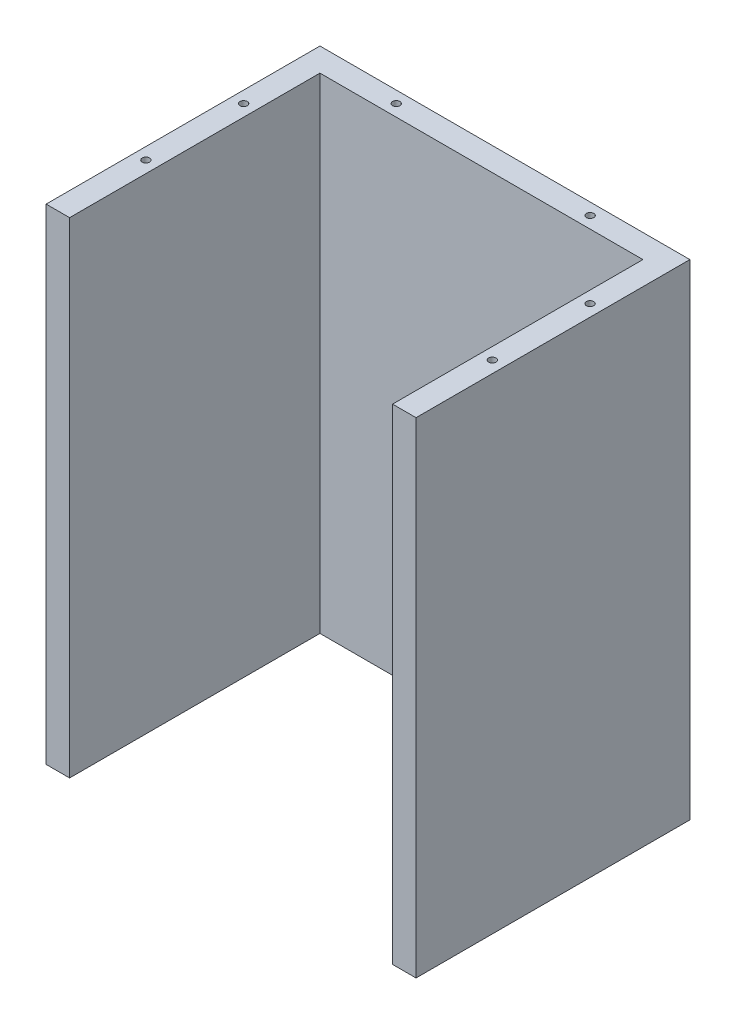
ISO-10303-21;
HEADER;
FILE_DESCRIPTION(('STEP AP214'),'2;1');
FILE_NAME('part.step','',(''),(''),'','','');
FILE_SCHEMA(('AUTOMOTIVE_DESIGN { 1 0 10303 214 1 1 1 1 }'));
ENDSEC;
DATA;
#1=APPLICATION_CONTEXT('core data for automotive mechanical design processes');
#2=APPLICATION_PROTOCOL_DEFINITION('international standard','automotive_design',2000,#1);
#3=PRODUCT_CONTEXT('',#1,'mechanical');
#4=PRODUCT('Part','Part','',(#3));
#5=PRODUCT_RELATED_PRODUCT_CATEGORY('part','',(#4));
#6=PRODUCT_DEFINITION_FORMATION('','',#4);
#7=PRODUCT_DEFINITION_CONTEXT('part definition',#1,'design');
#8=PRODUCT_DEFINITION('design','',#6,#7);
#9=PRODUCT_DEFINITION_SHAPE('','',#8);
#10=(LENGTH_UNIT() NAMED_UNIT(*) SI_UNIT(.MILLI.,.METRE.));
#11=(NAMED_UNIT(*) PLANE_ANGLE_UNIT() SI_UNIT($,.RADIAN.));
#12=(NAMED_UNIT(*) SI_UNIT($,.STERADIAN.) SOLID_ANGLE_UNIT());
#13=UNCERTAINTY_MEASURE_WITH_UNIT(LENGTH_MEASURE(1.E-05),#10,'distance_accuracy_value','');
#14=(GEOMETRIC_REPRESENTATION_CONTEXT(3) GLOBAL_UNCERTAINTY_ASSIGNED_CONTEXT((#13)) GLOBAL_UNIT_ASSIGNED_CONTEXT((#10,
#11,#12)) REPRESENTATION_CONTEXT('',''));
#15=CARTESIAN_POINT('',(0.,0.,0.));
#16=DIRECTION('',(0.,0.,1.));
#17=DIRECTION('',(1.,0.,0.));
#18=AXIS2_PLACEMENT_3D('',#15,#16,#17);
#19=CARTESIAN_POINT('',(90.043,-423.302,82.55));
#20=DIRECTION('',(-1.,0.,0.));
#21=DIRECTION('',(0.,0.,1.));
#22=AXIS2_PLACEMENT_3D('',#19,#20,#21);
#23=PLANE('',#22);
#24=DIRECTION('',(0.,0.,1.));
#25=VECTOR('',#24,1.);
#26=CARTESIAN_POINT('',(90.043,-420.,82.55));
#27=LINE('',#26,#25);
#28=CARTESIAN_POINT('',(90.043,-420.,-59.25));
#29=VERTEX_POINT('',#28);
#30=CARTESIAN_POINT('',(90.043,-420.,59.25));
#31=VERTEX_POINT('',#30);
#32=EDGE_CURVE('E134',#29,#31,#27,.T.);
#33=ORIENTED_EDGE('',*,*,#32,.F.);
#34=DIRECTION('',(0.,-1.,0.));
#35=VECTOR('',#34,1.);
#36=CARTESIAN_POINT('',(90.043,-210.,-59.25));
#37=LINE('',#36,#35);
#38=CARTESIAN_POINT('',(90.043,-210.,-59.25));
#39=VERTEX_POINT('',#38);
#40=EDGE_CURVE('E179',#39,#29,#37,.T.);
#41=ORIENTED_EDGE('',*,*,#40,.F.);
#42=DIRECTION('',(0.,0.,1.));
#43=VECTOR('',#42,1.);
#44=CARTESIAN_POINT('',(90.043,-210.,0.));
#45=LINE('',#44,#43);
#46=CARTESIAN_POINT('',(90.043,-210.,59.25));
#47=VERTEX_POINT('',#46);
#48=EDGE_CURVE('E164',#39,#47,#45,.T.);
#49=ORIENTED_EDGE('',*,*,#48,.T.);
#50=DIRECTION('',(0.,-1.,0.));
#51=VECTOR('',#50,1.);
#52=CARTESIAN_POINT('',(90.043,-210.,59.25));
#53=LINE('',#52,#51);
#54=EDGE_CURVE('E147',#47,#31,#53,.T.);
#55=ORIENTED_EDGE('',*,*,#54,.T.);
#56=EDGE_LOOP('',(#33,#41,#49,#55));
#57=FACE_BOUND('',#56,.T.);
#58=ADVANCED_FACE('F50',(#57),#23,.F.);
#59=CARTESIAN_POINT('',(79.883,-210.,0.));
#60=DIRECTION('',(-1.,0.,0.));
#61=DIRECTION('',(0.,0.,1.));
#62=AXIS2_PLACEMENT_3D('',#59,#60,#61);
#63=PLANE('',#62);
#64=DIRECTION('',(0.,0.,1.));
#65=VECTOR('',#64,1.);
#66=CARTESIAN_POINT('',(79.883,-420.,0.));
#67=LINE('',#66,#65);
#68=CARTESIAN_POINT('',(79.883,-420.,-49.09));
#69=VERTEX_POINT('',#68);
#70=CARTESIAN_POINT('',(79.883,-420.,59.25));
#71=VERTEX_POINT('',#70);
#72=EDGE_CURVE('E132',#69,#71,#67,.T.);
#73=ORIENTED_EDGE('',*,*,#72,.T.);
#74=DIRECTION('',(0.,-1.,0.));
#75=VECTOR('',#74,1.);
#76=CARTESIAN_POINT('',(79.883,-210.,59.25));
#77=LINE('',#76,#75);
#78=CARTESIAN_POINT('',(79.883,-210.,59.25));
#79=VERTEX_POINT('',#78);
#80=EDGE_CURVE('E142',#79,#71,#77,.T.);
#81=ORIENTED_EDGE('',*,*,#80,.F.);
#82=DIRECTION('',(0.,0.,1.));
#83=VECTOR('',#82,1.);
#84=CARTESIAN_POINT('',(79.883,-210.,0.));
#85=LINE('',#84,#83);
#86=CARTESIAN_POINT('',(79.883,-210.,-49.09));
#87=VERTEX_POINT('',#86);
#88=EDGE_CURVE('E137',#87,#79,#85,.T.);
#89=ORIENTED_EDGE('',*,*,#88,.F.);
#90=DIRECTION('',(0.,-1.,0.));
#91=VECTOR('',#90,1.);
#92=CARTESIAN_POINT('',(79.883,-210.,-49.09));
#93=LINE('',#92,#91);
#94=EDGE_CURVE('E12',#87,#69,#93,.T.);
#95=ORIENTED_EDGE('',*,*,#94,.T.);
#96=EDGE_LOOP('',(#73,#81,#89,#95));
#97=FACE_BOUND('',#96,.T.);
#98=ADVANCED_FACE('F149',(#97),#63,.T.);
#99=CARTESIAN_POINT('',(0.,-210.,-49.09));
#100=DIRECTION('',(0.,0.,1.));
#101=DIRECTION('',(1.,0.,0.));
#102=AXIS2_PLACEMENT_3D('',#99,#100,#101);
#103=PLANE('',#102);
#104=DIRECTION('',(1.,0.,0.));
#105=VECTOR('',#104,1.);
#106=CARTESIAN_POINT('',(0.,-420.,-49.09));
#107=LINE('',#106,#105);
#108=CARTESIAN_POINT('',(-59.883,-420.,-49.09));
#109=VERTEX_POINT('',#108);
#110=EDGE_CURVE('E153',#109,#69,#107,.T.);
#111=ORIENTED_EDGE('',*,*,#110,.T.);
#112=ORIENTED_EDGE('',*,*,#94,.F.);
#113=DIRECTION('',(1.,0.,0.));
#114=VECTOR('',#113,1.);
#115=CARTESIAN_POINT('',(0.,-210.,-49.09));
#116=LINE('',#115,#114);
#117=CARTESIAN_POINT('',(-59.883,-210.,-49.09));
#118=VERTEX_POINT('',#117);
#119=EDGE_CURVE('E200',#118,#87,#116,.T.);
#120=ORIENTED_EDGE('',*,*,#119,.F.);
#121=DIRECTION('',(0.,-1.,0.));
#122=VECTOR('',#121,1.);
#123=CARTESIAN_POINT('',(-59.883,-210.,-49.09));
#124=LINE('',#123,#122);
#125=EDGE_CURVE('E59',#118,#109,#124,.T.);
#126=ORIENTED_EDGE('',*,*,#125,.T.);
#127=EDGE_LOOP('',(#111,#112,#120,#126));
#128=FACE_BOUND('',#127,.T.);
#129=ADVANCED_FACE('F199',(#128),#103,.T.);
#130=CARTESIAN_POINT('',(-59.883,-210.,0.));
#131=DIRECTION('',(1.,0.,0.));
#132=DIRECTION('',(0.,0.,-1.));
#133=AXIS2_PLACEMENT_3D('',#130,#131,#132);
#134=PLANE('',#133);
#135=DIRECTION('',(0.,0.,-1.));
#136=VECTOR('',#135,1.);
#137=CARTESIAN_POINT('',(-59.883,-420.,0.));
#138=LINE('',#137,#136);
#139=CARTESIAN_POINT('',(-59.883,-420.,59.25));
#140=VERTEX_POINT('',#139);
#141=EDGE_CURVE('E158',#140,#109,#138,.T.);
#142=ORIENTED_EDGE('',*,*,#141,.T.);
#143=ORIENTED_EDGE('',*,*,#125,.F.);
#144=DIRECTION('',(0.,0.,-1.));
#145=VECTOR('',#144,1.);
#146=CARTESIAN_POINT('',(-59.883,-210.,0.));
#147=LINE('',#146,#145);
#148=CARTESIAN_POINT('',(-59.883,-210.,59.25));
#149=VERTEX_POINT('',#148);
#150=EDGE_CURVE('E272',#149,#118,#147,.T.);
#151=ORIENTED_EDGE('',*,*,#150,.F.);
#152=DIRECTION('',(0.,-1.,0.));
#153=VECTOR('',#152,1.);
#154=CARTESIAN_POINT('',(-59.883,-210.,59.25));
#155=LINE('',#154,#153);
#156=EDGE_CURVE('E191',#149,#140,#155,.T.);
#157=ORIENTED_EDGE('',*,*,#156,.T.);
#158=EDGE_LOOP('',(#142,#143,#151,#157));
#159=FACE_BOUND('',#158,.T.);
#160=ADVANCED_FACE('F203',(#159),#134,.T.);
#161=CARTESIAN_POINT('',(0.,-210.,59.25));
#162=DIRECTION('',(0.,0.,-1.));
#163=DIRECTION('',(-1.,0.,0.));
#164=AXIS2_PLACEMENT_3D('',#161,#162,#163);
#165=PLANE('',#164);
#166=DIRECTION('',(-1.,0.,0.));
#167=VECTOR('',#166,1.);
#168=CARTESIAN_POINT('',(0.,-420.,59.25));
#169=LINE('',#168,#167);
#170=CARTESIAN_POINT('',(-70.043,-420.,59.25));
#171=VERTEX_POINT('',#170);
#172=EDGE_CURVE('E140',#140,#171,#169,.T.);
#173=ORIENTED_EDGE('',*,*,#172,.F.);
#174=ORIENTED_EDGE('',*,*,#156,.F.);
#175=DIRECTION('',(-1.,0.,0.));
#176=VECTOR('',#175,1.);
#177=CARTESIAN_POINT('',(0.,-210.,59.25));
#178=LINE('',#177,#176);
#179=CARTESIAN_POINT('',(-70.043,-210.,59.25));
#180=VERTEX_POINT('',#179);
#181=EDGE_CURVE('E211',#149,#180,#178,.T.);
#182=ORIENTED_EDGE('',*,*,#181,.T.);
#183=DIRECTION('',(0.,-1.,0.));
#184=VECTOR('',#183,1.);
#185=CARTESIAN_POINT('',(-70.043,-210.,59.25));
#186=LINE('',#185,#184);
#187=EDGE_CURVE('E187',#180,#171,#186,.T.);
#188=ORIENTED_EDGE('',*,*,#187,.T.);
#189=EDGE_LOOP('',(#173,#174,#182,#188));
#190=FACE_BOUND('',#189,.T.);
#191=ADVANCED_FACE('F210',(#190),#165,.F.);
#192=CARTESIAN_POINT('',(-70.043,-210.,0.));
#193=DIRECTION('',(1.,0.,0.));
#194=DIRECTION('',(0.,0.,-1.));
#195=AXIS2_PLACEMENT_3D('',#192,#193,#194);
#196=PLANE('',#195);
#197=DIRECTION('',(0.,0.,-1.));
#198=VECTOR('',#197,1.);
#199=CARTESIAN_POINT('',(-70.043,-420.,0.));
#200=LINE('',#199,#198);
#201=CARTESIAN_POINT('',(-70.043,-420.,-59.25));
#202=VERTEX_POINT('',#201);
#203=EDGE_CURVE('E171',#171,#202,#200,.T.);
#204=ORIENTED_EDGE('',*,*,#203,.F.);
#205=ORIENTED_EDGE('',*,*,#187,.F.);
#206=DIRECTION('',(0.,0.,-1.));
#207=VECTOR('',#206,1.);
#208=CARTESIAN_POINT('',(-70.043,-210.,0.));
#209=LINE('',#208,#207);
#210=CARTESIAN_POINT('',(-70.043,-210.,-59.25));
#211=VERTEX_POINT('',#210);
#212=EDGE_CURVE('E216',#180,#211,#209,.T.);
#213=ORIENTED_EDGE('',*,*,#212,.T.);
#214=DIRECTION('',(0.,-1.,0.));
#215=VECTOR('',#214,1.);
#216=CARTESIAN_POINT('',(-70.043,-210.,-59.25));
#217=LINE('',#216,#215);
#218=EDGE_CURVE('E183',#211,#202,#217,.T.);
#219=ORIENTED_EDGE('',*,*,#218,.T.);
#220=EDGE_LOOP('',(#204,#205,#213,#219));
#221=FACE_BOUND('',#220,.T.);
#222=ADVANCED_FACE('F214',(#221),#196,.F.);
#223=CARTESIAN_POINT('',(0.,-210.,-59.25));
#224=DIRECTION('',(0.,0.,-1.));
#225=DIRECTION('',(-1.,0.,0.));
#226=AXIS2_PLACEMENT_3D('',#223,#224,#225);
#227=PLANE('',#226);
#228=DIRECTION('',(-1.,0.,0.));
#229=VECTOR('',#228,1.);
#230=CARTESIAN_POINT('',(0.,-420.,-59.25));
#231=LINE('',#230,#229);
#232=EDGE_CURVE('E138',#29,#202,#231,.T.);
#233=ORIENTED_EDGE('',*,*,#232,.T.);
#234=ORIENTED_EDGE('',*,*,#218,.F.);
#235=DIRECTION('',(-1.,0.,0.));
#236=VECTOR('',#235,1.);
#237=CARTESIAN_POINT('',(0.,-210.,-59.25));
#238=LINE('',#237,#236);
#239=EDGE_CURVE('E278',#39,#211,#238,.T.);
#240=ORIENTED_EDGE('',*,*,#239,.F.);
#241=ORIENTED_EDGE('',*,*,#40,.T.);
#242=EDGE_LOOP('',(#233,#234,#240,#241));
#243=FACE_BOUND('',#242,.T.);
#244=ADVANCED_FACE('F218',(#243),#227,.T.);
#245=EDGE_CURVE('E129',#31,#71,#169,.T.);
#246=ORIENTED_EDGE('',*,*,#245,.F.);
#247=ORIENTED_EDGE('',*,*,#54,.F.);
#248=EDGE_CURVE('E66',#47,#79,#178,.T.);
#249=ORIENTED_EDGE('',*,*,#248,.T.);
#250=ORIENTED_EDGE('',*,*,#80,.T.);
#251=EDGE_LOOP('',(#246,#247,#249,#250));
#252=FACE_BOUND('',#251,.T.);
#253=ADVANCED_FACE('F143',(#252),#165,.F.);
#254=CARTESIAN_POINT('',(0.,-210.,0.));
#255=DIRECTION('',(0.,1.,0.));
#256=DIRECTION('',(0.,0.,-1.));
#257=AXIS2_PLACEMENT_3D('',#254,#255,#256);
#258=PLANE('',#257);
#259=CARTESIAN_POINT('',(-64.963,-210.,21.15));
#260=DIRECTION('',(0.,-1.,0.));
#261=DIRECTION('',(0.,0.,-1.));
#262=AXIS2_PLACEMENT_3D('',#259,#260,#261);
#263=CIRCLE('',#262,1.58749999999999);
#264=CARTESIAN_POINT('',(-64.963,-210.,19.5625));
#265=VERTEX_POINT('',#264);
#266=EDGE_CURVE('E223',#265,#265,#263,.T.);
#267=ORIENTED_EDGE('',*,*,#266,.T.);
#268=EDGE_LOOP('',(#267));
#269=FACE_BOUND('',#268,.T.);
#270=CARTESIAN_POINT('',(-64.963,-210.,-21.15));
#271=DIRECTION('',(0.,-1.,0.));
#272=DIRECTION('',(0.,0.,-1.));
#273=AXIS2_PLACEMENT_3D('',#270,#271,#272);
#274=CIRCLE('',#273,1.58749999999999);
#275=CARTESIAN_POINT('',(-64.963,-210.,-22.7375));
#276=VERTEX_POINT('',#275);
#277=EDGE_CURVE('E233',#276,#276,#274,.T.);
#278=ORIENTED_EDGE('',*,*,#277,.T.);
#279=EDGE_LOOP('',(#278));
#280=FACE_BOUND('',#279,.T.);
#281=CARTESIAN_POINT('',(-31.943,-210.,-54.17));
#282=DIRECTION('',(0.,-1.,0.));
#283=DIRECTION('',(0.,0.,-1.));
#284=AXIS2_PLACEMENT_3D('',#281,#282,#283);
#285=CIRCLE('',#284,1.58749999999999);
#286=CARTESIAN_POINT('',(-31.943,-210.,-55.7575));
#287=VERTEX_POINT('',#286);
#288=EDGE_CURVE('E241',#287,#287,#285,.T.);
#289=ORIENTED_EDGE('',*,*,#288,.T.);
#290=EDGE_LOOP('',(#289));
#291=FACE_BOUND('',#290,.T.);
#292=CARTESIAN_POINT('',(51.943,-210.,-54.17));
#293=DIRECTION('',(0.,-1.,0.));
#294=DIRECTION('',(0.,0.,-1.));
#295=AXIS2_PLACEMENT_3D('',#292,#293,#294);
#296=CIRCLE('',#295,1.58749999999999);
#297=CARTESIAN_POINT('',(51.943,-210.,-55.7575));
#298=VERTEX_POINT('',#297);
#299=EDGE_CURVE('E249',#298,#298,#296,.T.);
#300=ORIENTED_EDGE('',*,*,#299,.T.);
#301=EDGE_LOOP('',(#300));
#302=FACE_BOUND('',#301,.T.);
#303=CARTESIAN_POINT('',(84.963,-210.,-21.15));
#304=DIRECTION('',(0.,-1.,0.));
#305=DIRECTION('',(0.,0.,-1.));
#306=AXIS2_PLACEMENT_3D('',#303,#304,#305);
#307=CIRCLE('',#306,1.58749999999999);
#308=CARTESIAN_POINT('',(84.963,-210.,-22.7375));
#309=VERTEX_POINT('',#308);
#310=EDGE_CURVE('E257',#309,#309,#307,.T.);
#311=ORIENTED_EDGE('',*,*,#310,.T.);
#312=EDGE_LOOP('',(#311));
#313=FACE_BOUND('',#312,.T.);
#314=CARTESIAN_POINT('',(84.963,-210.,21.15));
#315=DIRECTION('',(0.,-1.,0.));
#316=DIRECTION('',(0.,0.,-1.));
#317=AXIS2_PLACEMENT_3D('',#314,#315,#316);
#318=CIRCLE('',#317,1.58749999999999);
#319=CARTESIAN_POINT('',(84.963,-210.,19.5625));
#320=VERTEX_POINT('',#319);
#321=EDGE_CURVE('E161',#320,#320,#318,.T.);
#322=ORIENTED_EDGE('',*,*,#321,.T.);
#323=EDGE_LOOP('',(#322));
#324=FACE_BOUND('',#323,.T.);
#325=ORIENTED_EDGE('',*,*,#88,.T.);
#326=ORIENTED_EDGE('',*,*,#248,.F.);
#327=ORIENTED_EDGE('',*,*,#48,.F.);
#328=ORIENTED_EDGE('',*,*,#239,.T.);
#329=ORIENTED_EDGE('',*,*,#212,.F.);
#330=ORIENTED_EDGE('',*,*,#181,.F.);
#331=ORIENTED_EDGE('',*,*,#150,.T.);
#332=ORIENTED_EDGE('',*,*,#119,.T.);
#333=EDGE_LOOP('',(#325,#326,#327,#328,#329,#330,#331,#332));
#334=FACE_BOUND('',#333,.T.);
#335=ADVANCED_FACE('F284',(#269,#280,#291,#302,#313,#324,#334),#258,.T.);
#336=CARTESIAN_POINT('',(84.963,-235.4,21.15));
#337=DIRECTION('',(0.,1.,0.));
#338=DIRECTION('',(0.,0.,-1.));
#339=AXIS2_PLACEMENT_3D('',#336,#337,#338);
#340=CONICAL_SURFACE('',#339,1.58749999999999,1.02974425867666);
#341=CARTESIAN_POINT('',(84.963,-236.353866232706,21.15));
#342=VERTEX_POINT('',#341);
#343=VERTEX_LOOP('',#342);
#344=FACE_BOUND('',#343,.T.);
#345=CARTESIAN_POINT('',(84.963,-235.4,21.15));
#346=DIRECTION('',(0.,-1.,0.));
#347=DIRECTION('',(0.,0.,-1.));
#348=AXIS2_PLACEMENT_3D('',#345,#346,#347);
#349=CIRCLE('',#348,1.58749999999999);
#350=CARTESIAN_POINT('',(84.963,-235.4,19.5625));
#351=VERTEX_POINT('',#350);
#352=EDGE_CURVE('E154',#351,#351,#349,.T.);
#353=ORIENTED_EDGE('',*,*,#352,.F.);
#354=EDGE_LOOP('',(#353));
#355=FACE_BOUND('',#354,.T.);
#356=ADVANCED_FACE('F286',(#344,#355),#340,.F.);
#357=CARTESIAN_POINT('',(84.963,-210.,21.15));
#358=DIRECTION('',(0.,1.,0.));
#359=DIRECTION('',(0.,0.,-1.));
#360=AXIS2_PLACEMENT_3D('',#357,#358,#359);
#361=CYLINDRICAL_SURFACE('',#360,1.58749999999999);
#362=ORIENTED_EDGE('',*,*,#352,.T.);
#363=EDGE_LOOP('',(#362));
#364=FACE_BOUND('',#363,.T.);
#365=ORIENTED_EDGE('',*,*,#321,.F.);
#366=EDGE_LOOP('',(#365));
#367=FACE_BOUND('',#366,.T.);
#368=ADVANCED_FACE('F292',(#364,#367),#361,.F.);
#369=CARTESIAN_POINT('',(84.963,-235.4,-21.15));
#370=DIRECTION('',(0.,1.,0.));
#371=DIRECTION('',(0.,0.,-1.));
#372=AXIS2_PLACEMENT_3D('',#369,#370,#371);
#373=CONICAL_SURFACE('',#372,1.58749999999999,1.02974425867666);
#374=CARTESIAN_POINT('',(84.963,-236.353866232706,-21.15));
#375=VERTEX_POINT('',#374);
#376=VERTEX_LOOP('',#375);
#377=FACE_BOUND('',#376,.T.);
#378=CARTESIAN_POINT('',(84.963,-235.4,-21.15));
#379=DIRECTION('',(0.,-1.,0.));
#380=DIRECTION('',(0.,0.,-1.));
#381=AXIS2_PLACEMENT_3D('',#378,#379,#380);
#382=CIRCLE('',#381,1.58749999999999);
#383=CARTESIAN_POINT('',(84.963,-235.4,-22.7375));
#384=VERTEX_POINT('',#383);
#385=EDGE_CURVE('E261',#384,#384,#382,.T.);
#386=ORIENTED_EDGE('',*,*,#385,.F.);
#387=EDGE_LOOP('',(#386));
#388=FACE_BOUND('',#387,.T.);
#389=ADVANCED_FACE('F417',(#377,#388),#373,.F.);
#390=CARTESIAN_POINT('',(84.963,-210.,-21.15));
#391=DIRECTION('',(0.,1.,0.));
#392=DIRECTION('',(0.,0.,-1.));
#393=AXIS2_PLACEMENT_3D('',#390,#391,#392);
#394=CYLINDRICAL_SURFACE('',#393,1.58749999999999);
#395=ORIENTED_EDGE('',*,*,#385,.T.);
#396=EDGE_LOOP('',(#395));
#397=FACE_BOUND('',#396,.T.);
#398=ORIENTED_EDGE('',*,*,#310,.F.);
#399=EDGE_LOOP('',(#398));
#400=FACE_BOUND('',#399,.T.);
#401=ADVANCED_FACE('F408',(#397,#400),#394,.F.);
#402=CARTESIAN_POINT('',(51.943,-235.4,-54.17));
#403=DIRECTION('',(0.,1.,0.));
#404=DIRECTION('',(0.,0.,-1.));
#405=AXIS2_PLACEMENT_3D('',#402,#403,#404);
#406=CONICAL_SURFACE('',#405,1.58749999999999,1.02974425867666);
#407=CARTESIAN_POINT('',(51.943,-236.353866232706,-54.17));
#408=VERTEX_POINT('',#407);
#409=VERTEX_LOOP('',#408);
#410=FACE_BOUND('',#409,.T.);
#411=CARTESIAN_POINT('',(51.943,-235.4,-54.17));
#412=DIRECTION('',(0.,-1.,0.));
#413=DIRECTION('',(0.,0.,-1.));
#414=AXIS2_PLACEMENT_3D('',#411,#412,#413);
#415=CIRCLE('',#414,1.58749999999999);
#416=CARTESIAN_POINT('',(51.943,-235.4,-55.7575));
#417=VERTEX_POINT('',#416);
#418=EDGE_CURVE('E253',#417,#417,#415,.T.);
#419=ORIENTED_EDGE('',*,*,#418,.F.);
#420=EDGE_LOOP('',(#419));
#421=FACE_BOUND('',#420,.T.);
#422=ADVANCED_FACE('F399',(#410,#421),#406,.F.);
#423=CARTESIAN_POINT('',(51.943,-210.,-54.17));
#424=DIRECTION('',(0.,1.,0.));
#425=DIRECTION('',(0.,0.,-1.));
#426=AXIS2_PLACEMENT_3D('',#423,#424,#425);
#427=CYLINDRICAL_SURFACE('',#426,1.58749999999999);
#428=ORIENTED_EDGE('',*,*,#418,.T.);
#429=EDGE_LOOP('',(#428));
#430=FACE_BOUND('',#429,.T.);
#431=ORIENTED_EDGE('',*,*,#299,.F.);
#432=EDGE_LOOP('',(#431));
#433=FACE_BOUND('',#432,.T.);
#434=ADVANCED_FACE('F390',(#430,#433),#427,.F.);
#435=CARTESIAN_POINT('',(-31.943,-235.4,-54.17));
#436=DIRECTION('',(0.,1.,0.));
#437=DIRECTION('',(0.,0.,-1.));
#438=AXIS2_PLACEMENT_3D('',#435,#436,#437);
#439=CONICAL_SURFACE('',#438,1.5875,1.02974425867666);
#440=CARTESIAN_POINT('',(-31.943,-236.353866232706,-54.17));
#441=VERTEX_POINT('',#440);
#442=VERTEX_LOOP('',#441);
#443=FACE_BOUND('',#442,.T.);
#444=CARTESIAN_POINT('',(-31.943,-235.4,-54.17));
#445=DIRECTION('',(0.,-1.,0.));
#446=DIRECTION('',(0.,0.,-1.));
#447=AXIS2_PLACEMENT_3D('',#444,#445,#446);
#448=CIRCLE('',#447,1.5875);
#449=CARTESIAN_POINT('',(-31.943,-235.4,-55.7575));
#450=VERTEX_POINT('',#449);
#451=EDGE_CURVE('E245',#450,#450,#448,.T.);
#452=ORIENTED_EDGE('',*,*,#451,.F.);
#453=EDGE_LOOP('',(#452));
#454=FACE_BOUND('',#453,.T.);
#455=ADVANCED_FACE('F381',(#443,#454),#439,.F.);
#456=CARTESIAN_POINT('',(-31.943,-210.,-54.17));
#457=DIRECTION('',(0.,1.,0.));
#458=DIRECTION('',(0.,0.,-1.));
#459=AXIS2_PLACEMENT_3D('',#456,#457,#458);
#460=CYLINDRICAL_SURFACE('',#459,1.58749999999999);
#461=ORIENTED_EDGE('',*,*,#451,.T.);
#462=EDGE_LOOP('',(#461));
#463=FACE_BOUND('',#462,.T.);
#464=ORIENTED_EDGE('',*,*,#288,.F.);
#465=EDGE_LOOP('',(#464));
#466=FACE_BOUND('',#465,.T.);
#467=ADVANCED_FACE('F372',(#463,#466),#460,.F.);
#468=CARTESIAN_POINT('',(-64.963,-235.4,-21.15));
#469=DIRECTION('',(0.,1.,0.));
#470=DIRECTION('',(0.,0.,-1.));
#471=AXIS2_PLACEMENT_3D('',#468,#469,#470);
#472=CONICAL_SURFACE('',#471,1.58749999999999,1.02974425867666);
#473=CARTESIAN_POINT('',(-64.963,-236.353866232706,-21.15));
#474=VERTEX_POINT('',#473);
#475=VERTEX_LOOP('',#474);
#476=FACE_BOUND('',#475,.T.);
#477=CARTESIAN_POINT('',(-64.963,-235.4,-21.15));
#478=DIRECTION('',(0.,-1.,0.));
#479=DIRECTION('',(0.,0.,-1.));
#480=AXIS2_PLACEMENT_3D('',#477,#478,#479);
#481=CIRCLE('',#480,1.58749999999999);
#482=CARTESIAN_POINT('',(-64.963,-235.4,-22.7375));
#483=VERTEX_POINT('',#482);
#484=EDGE_CURVE('E237',#483,#483,#481,.T.);
#485=ORIENTED_EDGE('',*,*,#484,.F.);
#486=EDGE_LOOP('',(#485));
#487=FACE_BOUND('',#486,.T.);
#488=ADVANCED_FACE('F363',(#476,#487),#472,.F.);
#489=CARTESIAN_POINT('',(-64.963,-210.,-21.15));
#490=DIRECTION('',(0.,1.,0.));
#491=DIRECTION('',(0.,0.,-1.));
#492=AXIS2_PLACEMENT_3D('',#489,#490,#491);
#493=CYLINDRICAL_SURFACE('',#492,1.58749999999999);
#494=ORIENTED_EDGE('',*,*,#484,.T.);
#495=EDGE_LOOP('',(#494));
#496=FACE_BOUND('',#495,.T.);
#497=ORIENTED_EDGE('',*,*,#277,.F.);
#498=EDGE_LOOP('',(#497));
#499=FACE_BOUND('',#498,.T.);
#500=ADVANCED_FACE('F354',(#496,#499),#493,.F.);
#501=CARTESIAN_POINT('',(-64.963,-235.4,21.15));
#502=DIRECTION('',(0.,1.,0.));
#503=DIRECTION('',(0.,0.,-1.));
#504=AXIS2_PLACEMENT_3D('',#501,#502,#503);
#505=CONICAL_SURFACE('',#504,1.58749999999999,1.02974425867666);
#506=CARTESIAN_POINT('',(-64.963,-236.353866232706,21.15));
#507=VERTEX_POINT('',#506);
#508=VERTEX_LOOP('',#507);
#509=FACE_BOUND('',#508,.T.);
#510=CARTESIAN_POINT('',(-64.963,-235.4,21.15));
#511=DIRECTION('',(0.,-1.,0.));
#512=DIRECTION('',(0.,0.,-1.));
#513=AXIS2_PLACEMENT_3D('',#510,#511,#512);
#514=CIRCLE('',#513,1.58749999999999);
#515=CARTESIAN_POINT('',(-64.963,-235.4,19.5625));
#516=VERTEX_POINT('',#515);
#517=EDGE_CURVE('E227',#516,#516,#514,.T.);
#518=ORIENTED_EDGE('',*,*,#517,.F.);
#519=EDGE_LOOP('',(#518));
#520=FACE_BOUND('',#519,.T.);
#521=ADVANCED_FACE('F344',(#509,#520),#505,.F.);
#522=CARTESIAN_POINT('',(-64.963,-210.,21.15));
#523=DIRECTION('',(0.,1.,0.));
#524=DIRECTION('',(0.,0.,-1.));
#525=AXIS2_PLACEMENT_3D('',#522,#523,#524);
#526=CYLINDRICAL_SURFACE('',#525,1.58749999999999);
#527=ORIENTED_EDGE('',*,*,#517,.T.);
#528=EDGE_LOOP('',(#527));
#529=FACE_BOUND('',#528,.T.);
#530=ORIENTED_EDGE('',*,*,#266,.F.);
#531=EDGE_LOOP('',(#530));
#532=FACE_BOUND('',#531,.T.);
#533=ADVANCED_FACE('F330',(#529,#532),#526,.F.);
#534=CARTESIAN_POINT('',(0.,-420.,0.));
#535=DIRECTION('',(0.,-1.,0.));
#536=DIRECTION('',(0.,0.,-1.));
#537=AXIS2_PLACEMENT_3D('',#534,#535,#536);
#538=PLANE('',#537);
#539=ORIENTED_EDGE('',*,*,#32,.T.);
#540=ORIENTED_EDGE('',*,*,#245,.T.);
#541=ORIENTED_EDGE('',*,*,#72,.F.);
#542=ORIENTED_EDGE('',*,*,#110,.F.);
#543=ORIENTED_EDGE('',*,*,#141,.F.);
#544=ORIENTED_EDGE('',*,*,#172,.T.);
#545=ORIENTED_EDGE('',*,*,#203,.T.);
#546=ORIENTED_EDGE('',*,*,#232,.F.);
#547=EDGE_LOOP('',(#539,#540,#541,#542,#543,#544,#545,#546));
#548=FACE_BOUND('',#547,.T.);
#549=ADVANCED_FACE('F130',(#548),#538,.T.);
#550=CLOSED_SHELL('',(#58,#98,#129,#160,#191,#222,#244,#253,#335,#356,#368,#389,#401,#422,#434,
#455,#467,#488,#500,#521,#533,#549));
#551=MANIFOLD_SOLID_BREP('B2',#550);
#552=CARTESIAN_POINT('',(90.043,3.302,82.55));
#553=DIRECTION('',(-1.,0.,0.));
#554=DIRECTION('',(0.,0.,1.));
#555=AXIS2_PLACEMENT_3D('',#552,#553,#554);
#556=PLANE('',#555);
#557=DIRECTION('',(0.,0.,-1.));
#558=VECTOR('',#557,1.);
#559=CARTESIAN_POINT('',(90.043,-209.998,82.55));
#560=LINE('',#559,#558);
#561=CARTESIAN_POINT('',(90.043,-209.998,59.25));
#562=VERTEX_POINT('',#561);
#563=CARTESIAN_POINT('',(90.043,-209.998,-59.25));
#564=VERTEX_POINT('',#563);
#565=EDGE_CURVE('E593',#562,#564,#560,.T.);
#566=ORIENTED_EDGE('',*,*,#565,.F.);
#567=DIRECTION('',(0.,1.,0.));
#568=VECTOR('',#567,1.);
#569=CARTESIAN_POINT('',(90.043,-210.,59.25));
#570=LINE('',#569,#568);
#571=CARTESIAN_POINT('',(90.043,-210.,59.25));
#572=VERTEX_POINT('',#571);
#573=EDGE_CURVE('E604',#572,#562,#570,.T.);
#574=ORIENTED_EDGE('',*,*,#573,.F.);
#575=DIRECTION('',(0.,0.,1.));
#576=VECTOR('',#575,1.);
#577=CARTESIAN_POINT('',(90.043,-210.,0.));
#578=LINE('',#577,#576);
#579=CARTESIAN_POINT('',(90.043,-210.,-59.25));
#580=VERTEX_POINT('',#579);
#581=EDGE_CURVE('E654',#580,#572,#578,.T.);
#582=ORIENTED_EDGE('',*,*,#581,.F.);
#583=DIRECTION('',(0.,1.,0.));
#584=VECTOR('',#583,1.);
#585=CARTESIAN_POINT('',(90.043,-210.,-59.25));
#586=LINE('',#585,#584);
#587=EDGE_CURVE('E605',#580,#564,#586,.T.);
#588=ORIENTED_EDGE('',*,*,#587,.T.);
#589=EDGE_LOOP('',(#566,#574,#582,#588));
#590=FACE_BOUND('',#589,.T.);
#591=ADVANCED_FACE('F526',(#590),#556,.F.);
#592=CARTESIAN_POINT('',(79.883,-210.,0.));
#593=DIRECTION('',(-1.,0.,0.));
#594=DIRECTION('',(0.,0.,1.));
#595=AXIS2_PLACEMENT_3D('',#592,#593,#594);
#596=PLANE('',#595);
#597=DIRECTION('',(0.,1.,0.));
#598=VECTOR('',#597,1.);
#599=CARTESIAN_POINT('',(79.883,-210.,59.25));
#600=LINE('',#599,#598);
#601=CARTESIAN_POINT('',(79.883,-210.,59.25));
#602=VERTEX_POINT('',#601);
#603=CARTESIAN_POINT('',(79.883,-209.998,59.25));
#604=VERTEX_POINT('',#603);
#605=EDGE_CURVE('E609',#602,#604,#600,.T.);
#606=ORIENTED_EDGE('',*,*,#605,.T.);
#607=DIRECTION('',(0.,0.,-1.));
#608=VECTOR('',#607,1.);
#609=CARTESIAN_POINT('',(79.883,-209.998,0.));
#610=LINE('',#609,#608);
#611=CARTESIAN_POINT('',(79.883,-209.998,-49.09));
#612=VERTEX_POINT('',#611);
#613=EDGE_CURVE('E541',#604,#612,#610,.T.);
#614=ORIENTED_EDGE('',*,*,#613,.T.);
#615=DIRECTION('',(0.,1.,0.));
#616=VECTOR('',#615,1.);
#617=CARTESIAN_POINT('',(79.883,-210.,-49.09));
#618=LINE('',#617,#616);
#619=CARTESIAN_POINT('',(79.883,-210.,-49.09));
#620=VERTEX_POINT('',#619);
#621=EDGE_CURVE('E48',#620,#612,#618,.T.);
#622=ORIENTED_EDGE('',*,*,#621,.F.);
#623=DIRECTION('',(0.,0.,1.));
#624=VECTOR('',#623,1.);
#625=CARTESIAN_POINT('',(79.883,-210.,0.));
#626=LINE('',#625,#624);
#627=EDGE_CURVE('E641',#620,#602,#626,.T.);
#628=ORIENTED_EDGE('',*,*,#627,.T.);
#629=EDGE_LOOP('',(#606,#614,#622,#628));
#630=FACE_BOUND('',#629,.T.);
#631=ADVANCED_FACE('F708',(#630),#596,.T.);
#632=CARTESIAN_POINT('',(0.,-210.,-49.09));
#633=DIRECTION('',(0.,0.,1.));
#634=DIRECTION('',(1.,0.,0.));
#635=AXIS2_PLACEMENT_3D('',#632,#633,#634);
#636=PLANE('',#635);
#637=ORIENTED_EDGE('',*,*,#621,.T.);
#638=DIRECTION('',(-1.,0.,0.));
#639=VECTOR('',#638,1.);
#640=CARTESIAN_POINT('',(0.,-209.998,-49.09));
#641=LINE('',#640,#639);
#642=CARTESIAN_POINT('',(-59.883,-209.998,-49.09));
#643=VERTEX_POINT('',#642);
#644=EDGE_CURVE('E638',#612,#643,#641,.T.);
#645=ORIENTED_EDGE('',*,*,#644,.T.);
#646=DIRECTION('',(0.,1.,0.));
#647=VECTOR('',#646,1.);
#648=CARTESIAN_POINT('',(-59.883,-210.,-49.09));
#649=LINE('',#648,#647);
#650=CARTESIAN_POINT('',(-59.883,-210.,-49.09));
#651=VERTEX_POINT('',#650);
#652=EDGE_CURVE('E534',#651,#643,#649,.T.);
#653=ORIENTED_EDGE('',*,*,#652,.F.);
#654=DIRECTION('',(1.,0.,0.));
#655=VECTOR('',#654,1.);
#656=CARTESIAN_POINT('',(0.,-210.,-49.09));
#657=LINE('',#656,#655);
#658=EDGE_CURVE('E637',#651,#620,#657,.T.);
#659=ORIENTED_EDGE('',*,*,#658,.T.);
#660=EDGE_LOOP('',(#637,#645,#653,#659));
#661=FACE_BOUND('',#660,.T.);
#662=ADVANCED_FACE('F636',(#661),#636,.T.);
#663=CARTESIAN_POINT('',(-59.883,-210.,0.));
#664=DIRECTION('',(1.,0.,0.));
#665=DIRECTION('',(0.,0.,-1.));
#666=AXIS2_PLACEMENT_3D('',#663,#664,#665);
#667=PLANE('',#666);
#668=ORIENTED_EDGE('',*,*,#652,.T.);
#669=DIRECTION('',(0.,0.,1.));
#670=VECTOR('',#669,1.);
#671=CARTESIAN_POINT('',(-59.883,-209.998,0.));
#672=LINE('',#671,#670);
#673=CARTESIAN_POINT('',(-59.883,-209.998,59.25));
#674=VERTEX_POINT('',#673);
#675=EDGE_CURVE('E629',#643,#674,#672,.T.);
#676=ORIENTED_EDGE('',*,*,#675,.T.);
#677=DIRECTION('',(0.,1.,0.));
#678=VECTOR('',#677,1.);
#679=CARTESIAN_POINT('',(-59.883,-210.,59.25));
#680=LINE('',#679,#678);
#681=CARTESIAN_POINT('',(-59.883,-210.,59.25));
#682=VERTEX_POINT('',#681);
#683=EDGE_CURVE('E621',#682,#674,#680,.T.);
#684=ORIENTED_EDGE('',*,*,#683,.F.);
#685=DIRECTION('',(0.,0.,-1.));
#686=VECTOR('',#685,1.);
#687=CARTESIAN_POINT('',(-59.883,-210.,0.));
#688=LINE('',#687,#686);
#689=EDGE_CURVE('E631',#682,#651,#688,.T.);
#690=ORIENTED_EDGE('',*,*,#689,.T.);
#691=EDGE_LOOP('',(#668,#676,#684,#690));
#692=FACE_BOUND('',#691,.T.);
#693=ADVANCED_FACE('F628',(#692),#667,.T.);
#694=CARTESIAN_POINT('',(0.,-210.,59.25));
#695=DIRECTION('',(0.,0.,-1.));
#696=DIRECTION('',(-1.,0.,0.));
#697=AXIS2_PLACEMENT_3D('',#694,#695,#696);
#698=PLANE('',#697);
#699=DIRECTION('',(1.,0.,0.));
#700=VECTOR('',#699,1.);
#701=CARTESIAN_POINT('',(0.,-209.998,59.25));
#702=LINE('',#701,#700);
#703=CARTESIAN_POINT('',(-70.043,-209.998,59.25));
#704=VERTEX_POINT('',#703);
#705=EDGE_CURVE('E663',#704,#674,#702,.T.);
#706=ORIENTED_EDGE('',*,*,#705,.F.);
#707=DIRECTION('',(0.,1.,0.));
#708=VECTOR('',#707,1.);
#709=CARTESIAN_POINT('',(-70.043,-210.,59.25));
#710=LINE('',#709,#708);
#711=CARTESIAN_POINT('',(-70.043,-210.,59.25));
#712=VERTEX_POINT('',#711);
#713=EDGE_CURVE('E618',#712,#704,#710,.T.);
#714=ORIENTED_EDGE('',*,*,#713,.F.);
#715=DIRECTION('',(-1.,0.,0.));
#716=VECTOR('',#715,1.);
#717=CARTESIAN_POINT('',(0.,-210.,59.25));
#718=LINE('',#717,#716);
#719=EDGE_CURVE('E643',#682,#712,#718,.T.);
#720=ORIENTED_EDGE('',*,*,#719,.F.);
#721=ORIENTED_EDGE('',*,*,#683,.T.);
#722=EDGE_LOOP('',(#706,#714,#720,#721));
#723=FACE_BOUND('',#722,.T.);
#724=ADVANCED_FACE('F720',(#723),#698,.F.);
#725=CARTESIAN_POINT('',(-70.043,-210.,0.));
#726=DIRECTION('',(1.,0.,0.));
#727=DIRECTION('',(0.,0.,-1.));
#728=AXIS2_PLACEMENT_3D('',#725,#726,#727);
#729=PLANE('',#728);
#730=DIRECTION('',(0.,0.,1.));
#731=VECTOR('',#730,1.);
#732=CARTESIAN_POINT('',(-70.043,-209.998,0.));
#733=LINE('',#732,#731);
#734=CARTESIAN_POINT('',(-70.043,-209.998,-59.25));
#735=VERTEX_POINT('',#734);
#736=EDGE_CURVE('E661',#735,#704,#733,.T.);
#737=ORIENTED_EDGE('',*,*,#736,.F.);
#738=DIRECTION('',(0.,1.,0.));
#739=VECTOR('',#738,1.);
#740=CARTESIAN_POINT('',(-70.043,-210.,-59.25));
#741=LINE('',#740,#739);
#742=CARTESIAN_POINT('',(-70.043,-210.,-59.25));
#743=VERTEX_POINT('',#742);
#744=EDGE_CURVE('E611',#743,#735,#741,.T.);
#745=ORIENTED_EDGE('',*,*,#744,.F.);
#746=DIRECTION('',(0.,0.,-1.));
#747=VECTOR('',#746,1.);
#748=CARTESIAN_POINT('',(-70.043,-210.,0.));
#749=LINE('',#748,#747);
#750=EDGE_CURVE('E650',#712,#743,#749,.T.);
#751=ORIENTED_EDGE('',*,*,#750,.F.);
#752=ORIENTED_EDGE('',*,*,#713,.T.);
#753=EDGE_LOOP('',(#737,#745,#751,#752));
#754=FACE_BOUND('',#753,.T.);
#755=ADVANCED_FACE('F721',(#754),#729,.F.);
#756=CARTESIAN_POINT('',(0.,-210.,-59.25));
#757=DIRECTION('',(0.,0.,-1.));
#758=DIRECTION('',(-1.,0.,0.));
#759=AXIS2_PLACEMENT_3D('',#756,#757,#758);
#760=PLANE('',#759);
#761=ORIENTED_EDGE('',*,*,#744,.T.);
#762=DIRECTION('',(1.,0.,0.));
#763=VECTOR('',#762,1.);
#764=CARTESIAN_POINT('',(0.,-209.998,-59.25));
#765=LINE('',#764,#763);
#766=EDGE_CURVE('E606',#735,#564,#765,.T.);
#767=ORIENTED_EDGE('',*,*,#766,.T.);
#768=ORIENTED_EDGE('',*,*,#587,.F.);
#769=DIRECTION('',(-1.,0.,0.));
#770=VECTOR('',#769,1.);
#771=CARTESIAN_POINT('',(0.,-210.,-59.25));
#772=LINE('',#771,#770);
#773=EDGE_CURVE('E652',#580,#743,#772,.T.);
#774=ORIENTED_EDGE('',*,*,#773,.T.);
#775=EDGE_LOOP('',(#761,#767,#768,#774));
#776=FACE_BOUND('',#775,.T.);
#777=ADVANCED_FACE('F659',(#776),#760,.T.);
#778=DIRECTION('',(1.,0.,0.));
#779=VECTOR('',#778,1.);
#780=CARTESIAN_POINT('',(0.,-209.998,59.25));
#781=LINE('',#780,#779);
#782=EDGE_CURVE('E589',#604,#562,#781,.T.);
#783=ORIENTED_EDGE('',*,*,#782,.F.);
#784=ORIENTED_EDGE('',*,*,#605,.F.);
#785=EDGE_CURVE('E549',#572,#602,#718,.T.);
#786=ORIENTED_EDGE('',*,*,#785,.F.);
#787=ORIENTED_EDGE('',*,*,#573,.T.);
#788=EDGE_LOOP('',(#783,#784,#786,#787));
#789=FACE_BOUND('',#788,.T.);
#790=ADVANCED_FACE('F608',(#789),#698,.F.);
#791=CARTESIAN_POINT('',(84.963,-210.,21.15));
#792=DIRECTION('',(0.,-1.,0.));
#793=DIRECTION('',(0.,0.,-1.));
#794=AXIS2_PLACEMENT_3D('',#791,#792,#793);
#795=CYLINDRICAL_SURFACE('',#794,1.58749999999999);
#796=CARTESIAN_POINT('',(84.963,-210.,21.15));
#797=DIRECTION('',(0.,-1.,0.));
#798=DIRECTION('',(0.,0.,-1.));
#799=AXIS2_PLACEMENT_3D('',#796,#797,#798);
#800=CIRCLE('',#799,1.58749999999999);
#801=CARTESIAN_POINT('',(84.963,-210.,19.5625));
#802=VERTEX_POINT('',#801);
#803=EDGE_CURVE('E645',#802,#802,#800,.T.);
#804=ORIENTED_EDGE('',*,*,#803,.T.);
#805=EDGE_LOOP('',(#804));
#806=FACE_BOUND('',#805,.T.);
#807=CARTESIAN_POINT('',(84.963,-209.998,21.15));
#808=DIRECTION('',(0.,1.,0.));
#809=DIRECTION('',(0.,0.,1.));
#810=AXIS2_PLACEMENT_3D('',#807,#808,#809);
#811=CIRCLE('',#810,1.58749999999999);
#812=CARTESIAN_POINT('',(84.963,-209.998,22.7375));
#813=VERTEX_POINT('',#812);
#814=EDGE_CURVE('E598',#813,#813,#811,.F.);
#815=ORIENTED_EDGE('',*,*,#814,.F.);
#816=EDGE_LOOP('',(#815));
#817=FACE_BOUND('',#816,.T.);
#818=ADVANCED_FACE('F687',(#806,#817),#795,.F.);
#819=CARTESIAN_POINT('',(84.963,-210.,-21.15));
#820=DIRECTION('',(0.,-1.,0.));
#821=DIRECTION('',(0.,0.,-1.));
#822=AXIS2_PLACEMENT_3D('',#819,#820,#821);
#823=CYLINDRICAL_SURFACE('',#822,1.58749999999999);
#824=CARTESIAN_POINT('',(84.963,-210.,-21.15));
#825=DIRECTION('',(0.,-1.,0.));
#826=DIRECTION('',(0.,0.,-1.));
#827=AXIS2_PLACEMENT_3D('',#824,#825,#826);
#828=CIRCLE('',#827,1.58749999999999);
#829=CARTESIAN_POINT('',(84.963,-210.,-22.7375));
#830=VERTEX_POINT('',#829);
#831=EDGE_CURVE('E682',#830,#830,#828,.T.);
#832=ORIENTED_EDGE('',*,*,#831,.T.);
#833=EDGE_LOOP('',(#832));
#834=FACE_BOUND('',#833,.T.);
#835=CARTESIAN_POINT('',(84.963,-209.998,-21.15));
#836=DIRECTION('',(0.,1.,0.));
#837=DIRECTION('',(0.,0.,1.));
#838=AXIS2_PLACEMENT_3D('',#835,#836,#837);
#839=CIRCLE('',#838,1.58749999999999);
#840=CARTESIAN_POINT('',(84.963,-209.998,-19.5625));
#841=VERTEX_POINT('',#840);
#842=EDGE_CURVE('E769',#841,#841,#839,.F.);
#843=ORIENTED_EDGE('',*,*,#842,.F.);
#844=EDGE_LOOP('',(#843));
#845=FACE_BOUND('',#844,.T.);
#846=ADVANCED_FACE('F735',(#834,#845),#823,.F.);
#847=CARTESIAN_POINT('',(51.943,-210.,-54.17));
#848=DIRECTION('',(0.,-1.,0.));
#849=DIRECTION('',(0.,0.,-1.));
#850=AXIS2_PLACEMENT_3D('',#847,#848,#849);
#851=CYLINDRICAL_SURFACE('',#850,1.58749999999999);
#852=CARTESIAN_POINT('',(51.943,-210.,-54.17));
#853=DIRECTION('',(0.,-1.,0.));
#854=DIRECTION('',(0.,0.,-1.));
#855=AXIS2_PLACEMENT_3D('',#852,#853,#854);
#856=CIRCLE('',#855,1.58749999999999);
#857=CARTESIAN_POINT('',(51.943,-210.,-55.7575));
#858=VERTEX_POINT('',#857);
#859=EDGE_CURVE('E679',#858,#858,#856,.T.);
#860=ORIENTED_EDGE('',*,*,#859,.T.);
#861=EDGE_LOOP('',(#860));
#862=FACE_BOUND('',#861,.T.);
#863=CARTESIAN_POINT('',(51.943,-209.998,-54.17));
#864=DIRECTION('',(0.,1.,0.));
#865=DIRECTION('',(0.,0.,1.));
#866=AXIS2_PLACEMENT_3D('',#863,#864,#865);
#867=CIRCLE('',#866,1.58749999999999);
#868=CARTESIAN_POINT('',(51.943,-209.998,-52.5825));
#869=VERTEX_POINT('',#868);
#870=EDGE_CURVE('E763',#869,#869,#867,.F.);
#871=ORIENTED_EDGE('',*,*,#870,.F.);
#872=EDGE_LOOP('',(#871));
#873=FACE_BOUND('',#872,.T.);
#874=ADVANCED_FACE('F739',(#862,#873),#851,.F.);
#875=CARTESIAN_POINT('',(-31.943,-210.,-54.17));
#876=DIRECTION('',(0.,-1.,0.));
#877=DIRECTION('',(0.,0.,-1.));
#878=AXIS2_PLACEMENT_3D('',#875,#876,#877);
#879=CYLINDRICAL_SURFACE('',#878,1.58749999999999);
#880=CARTESIAN_POINT('',(-31.943,-210.,-54.17));
#881=DIRECTION('',(0.,-1.,0.));
#882=DIRECTION('',(0.,0.,-1.));
#883=AXIS2_PLACEMENT_3D('',#880,#881,#882);
#884=CIRCLE('',#883,1.58749999999999);
#885=CARTESIAN_POINT('',(-31.943,-210.,-55.7575));
#886=VERTEX_POINT('',#885);
#887=EDGE_CURVE('E676',#886,#886,#884,.T.);
#888=ORIENTED_EDGE('',*,*,#887,.T.);
#889=EDGE_LOOP('',(#888));
#890=FACE_BOUND('',#889,.T.);
#891=CARTESIAN_POINT('',(-31.943,-209.998,-54.17));
#892=DIRECTION('',(0.,1.,0.));
#893=DIRECTION('',(0.,0.,1.));
#894=AXIS2_PLACEMENT_3D('',#891,#892,#893);
#895=CIRCLE('',#894,1.58749999999999);
#896=CARTESIAN_POINT('',(-31.943,-209.998,-52.5825));
#897=VERTEX_POINT('',#896);
#898=EDGE_CURVE('E760',#897,#897,#895,.F.);
#899=ORIENTED_EDGE('',*,*,#898,.F.);
#900=EDGE_LOOP('',(#899));
#901=FACE_BOUND('',#900,.T.);
#902=ADVANCED_FACE('F745',(#890,#901),#879,.F.);
#903=CARTESIAN_POINT('',(-64.963,-210.,-21.15));
#904=DIRECTION('',(0.,-1.,0.));
#905=DIRECTION('',(0.,0.,-1.));
#906=AXIS2_PLACEMENT_3D('',#903,#904,#905);
#907=CYLINDRICAL_SURFACE('',#906,1.58749999999999);
#908=CARTESIAN_POINT('',(-64.963,-210.,-21.15));
#909=DIRECTION('',(0.,-1.,0.));
#910=DIRECTION('',(0.,0.,-1.));
#911=AXIS2_PLACEMENT_3D('',#908,#909,#910);
#912=CIRCLE('',#911,1.58749999999999);
#913=CARTESIAN_POINT('',(-64.963,-210.,-22.7375));
#914=VERTEX_POINT('',#913);
#915=EDGE_CURVE('E673',#914,#914,#912,.T.);
#916=ORIENTED_EDGE('',*,*,#915,.T.);
#917=EDGE_LOOP('',(#916));
#918=FACE_BOUND('',#917,.T.);
#919=CARTESIAN_POINT('',(-64.963,-209.998,-21.15));
#920=DIRECTION('',(0.,1.,0.));
#921=DIRECTION('',(0.,0.,1.));
#922=AXIS2_PLACEMENT_3D('',#919,#920,#921);
#923=CIRCLE('',#922,1.58749999999999);
#924=CARTESIAN_POINT('',(-64.963,-209.998,-19.5625));
#925=VERTEX_POINT('',#924);
#926=EDGE_CURVE('E758',#925,#925,#923,.F.);
#927=ORIENTED_EDGE('',*,*,#926,.F.);
#928=EDGE_LOOP('',(#927));
#929=FACE_BOUND('',#928,.T.);
#930=ADVANCED_FACE('F700',(#918,#929),#907,.F.);
#931=CARTESIAN_POINT('',(-64.963,-210.,21.15));
#932=DIRECTION('',(0.,-1.,0.));
#933=DIRECTION('',(0.,0.,-1.));
#934=AXIS2_PLACEMENT_3D('',#931,#932,#933);
#935=CYLINDRICAL_SURFACE('',#934,1.58749999999999);
#936=CARTESIAN_POINT('',(-64.963,-210.,21.15));
#937=DIRECTION('',(0.,-1.,0.));
#938=DIRECTION('',(0.,0.,-1.));
#939=AXIS2_PLACEMENT_3D('',#936,#937,#938);
#940=CIRCLE('',#939,1.58749999999999);
#941=CARTESIAN_POINT('',(-64.963,-210.,19.5625));
#942=VERTEX_POINT('',#941);
#943=EDGE_CURVE('E670',#942,#942,#940,.T.);
#944=ORIENTED_EDGE('',*,*,#943,.T.);
#945=EDGE_LOOP('',(#944));
#946=FACE_BOUND('',#945,.T.);
#947=CARTESIAN_POINT('',(-64.963,-209.998,21.15));
#948=DIRECTION('',(0.,1.,0.));
#949=DIRECTION('',(0.,0.,1.));
#950=AXIS2_PLACEMENT_3D('',#947,#948,#949);
#951=CIRCLE('',#950,1.58749999999999);
#952=CARTESIAN_POINT('',(-64.963,-209.998,22.7375));
#953=VERTEX_POINT('',#952);
#954=EDGE_CURVE('E529',#953,#953,#951,.F.);
#955=ORIENTED_EDGE('',*,*,#954,.F.);
#956=EDGE_LOOP('',(#955));
#957=FACE_BOUND('',#956,.T.);
#958=ADVANCED_FACE('F691',(#946,#957),#935,.F.);
#959=CARTESIAN_POINT('',(0.,-210.,0.));
#960=DIRECTION('',(0.,-1.,0.));
#961=DIRECTION('',(0.,0.,-1.));
#962=AXIS2_PLACEMENT_3D('',#959,#960,#961);
#963=PLANE('',#962);
#964=ORIENTED_EDGE('',*,*,#943,.F.);
#965=EDGE_LOOP('',(#964));
#966=FACE_BOUND('',#965,.T.);
#967=ORIENTED_EDGE('',*,*,#915,.F.);
#968=EDGE_LOOP('',(#967));
#969=FACE_BOUND('',#968,.T.);
#970=ORIENTED_EDGE('',*,*,#887,.F.);
#971=EDGE_LOOP('',(#970));
#972=FACE_BOUND('',#971,.T.);
#973=ORIENTED_EDGE('',*,*,#859,.F.);
#974=EDGE_LOOP('',(#973));
#975=FACE_BOUND('',#974,.T.);
#976=ORIENTED_EDGE('',*,*,#831,.F.);
#977=EDGE_LOOP('',(#976));
#978=FACE_BOUND('',#977,.T.);
#979=ORIENTED_EDGE('',*,*,#803,.F.);
#980=EDGE_LOOP('',(#979));
#981=FACE_BOUND('',#980,.T.);
#982=ORIENTED_EDGE('',*,*,#627,.F.);
#983=ORIENTED_EDGE('',*,*,#658,.F.);
#984=ORIENTED_EDGE('',*,*,#689,.F.);
#985=ORIENTED_EDGE('',*,*,#719,.T.);
#986=ORIENTED_EDGE('',*,*,#750,.T.);
#987=ORIENTED_EDGE('',*,*,#773,.F.);
#988=ORIENTED_EDGE('',*,*,#581,.T.);
#989=ORIENTED_EDGE('',*,*,#785,.T.);
#990=EDGE_LOOP('',(#982,#983,#984,#985,#986,#987,#988,#989));
#991=FACE_BOUND('',#990,.T.);
#992=ADVANCED_FACE('F639',(#966,#969,#972,#975,#978,#981,#991),#963,.T.);
#993=CARTESIAN_POINT('',(0.,-209.998,0.));
#994=DIRECTION('',(0.,1.,0.));
#995=DIRECTION('',(0.,0.,1.));
#996=AXIS2_PLACEMENT_3D('',#993,#994,#995);
#997=PLANE('',#996);
#998=ORIENTED_EDGE('',*,*,#613,.F.);
#999=ORIENTED_EDGE('',*,*,#782,.T.);
#1000=ORIENTED_EDGE('',*,*,#565,.T.);
#1001=ORIENTED_EDGE('',*,*,#766,.F.);
#1002=ORIENTED_EDGE('',*,*,#736,.T.);
#1003=ORIENTED_EDGE('',*,*,#705,.T.);
#1004=ORIENTED_EDGE('',*,*,#675,.F.);
#1005=ORIENTED_EDGE('',*,*,#644,.F.);
#1006=EDGE_LOOP('',(#998,#999,#1000,#1001,#1002,#1003,#1004,#1005));
#1007=FACE_BOUND('',#1006,.T.);
#1008=ORIENTED_EDGE('',*,*,#954,.T.);
#1009=EDGE_LOOP('',(#1008));
#1010=FACE_BOUND('',#1009,.T.);
#1011=ORIENTED_EDGE('',*,*,#926,.T.);
#1012=EDGE_LOOP('',(#1011));
#1013=FACE_BOUND('',#1012,.T.);
#1014=ORIENTED_EDGE('',*,*,#898,.T.);
#1015=EDGE_LOOP('',(#1014));
#1016=FACE_BOUND('',#1015,.T.);
#1017=ORIENTED_EDGE('',*,*,#870,.T.);
#1018=EDGE_LOOP('',(#1017));
#1019=FACE_BOUND('',#1018,.T.);
#1020=ORIENTED_EDGE('',*,*,#842,.T.);
#1021=EDGE_LOOP('',(#1020));
#1022=FACE_BOUND('',#1021,.T.);
#1023=ORIENTED_EDGE('',*,*,#814,.T.);
#1024=EDGE_LOOP('',(#1023));
#1025=FACE_BOUND('',#1024,.T.);
#1026=ADVANCED_FACE('F591',(#1007,#1010,#1013,#1016,#1019,#1022,#1025),#997,.T.);
#1027=CLOSED_SHELL('',(#591,#631,#662,#693,#724,#755,#777,#790,#818,#846,#874,#902,#930,#958,
#992,#1026));
#1028=MANIFOLD_SOLID_BREP('B6',#1027);
#1029=ADVANCED_BREP_SHAPE_REPRESENTATION('',(#18,#551,#1028),#14);
#1030=SHAPE_DEFINITION_REPRESENTATION(#9,#1029);
ENDSEC;
END-ISO-10303-21;
